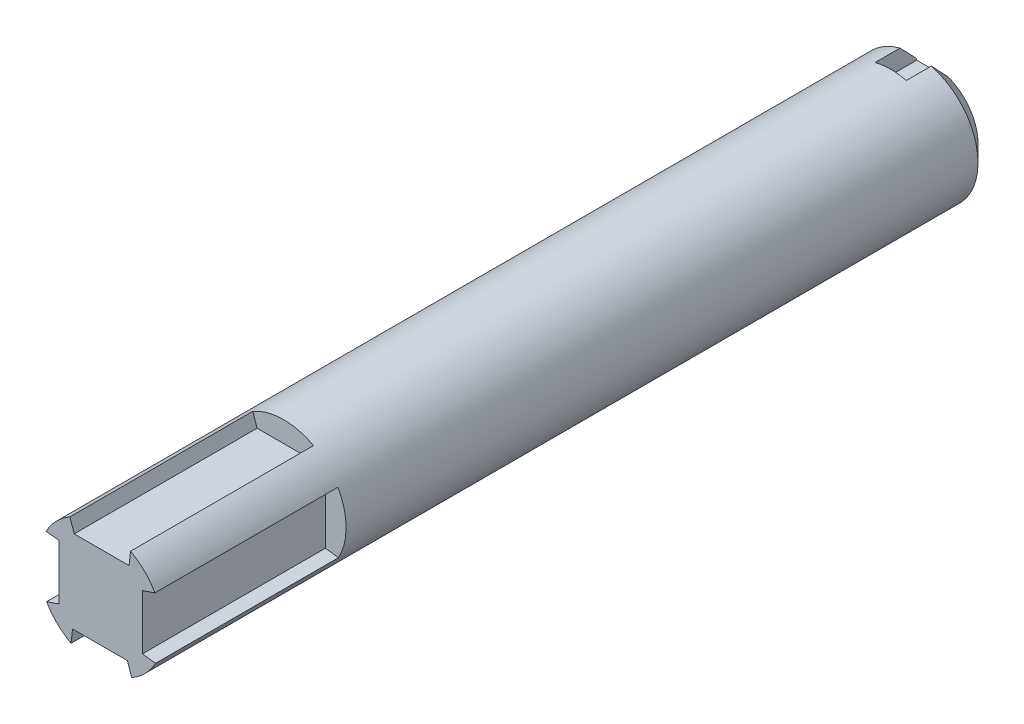
ISO-10303-21;
HEADER;
FILE_DESCRIPTION(('STEP AP214'),'2;1');
FILE_NAME('part.step','',(''),(''),'','','');
FILE_SCHEMA(('AUTOMOTIVE_DESIGN { 1 0 10303 214 1 1 1 1 }'));
ENDSEC;
DATA;
#1=APPLICATION_CONTEXT('core data for automotive mechanical design processes');
#2=APPLICATION_PROTOCOL_DEFINITION('international standard','automotive_design',2000,#1);
#3=PRODUCT_CONTEXT('',#1,'mechanical');
#4=PRODUCT('Part','Part','',(#3));
#5=PRODUCT_RELATED_PRODUCT_CATEGORY('part','',(#4));
#6=PRODUCT_DEFINITION_FORMATION('','',#4);
#7=PRODUCT_DEFINITION_CONTEXT('part definition',#1,'design');
#8=PRODUCT_DEFINITION('design','',#6,#7);
#9=PRODUCT_DEFINITION_SHAPE('','',#8);
#10=(LENGTH_UNIT() NAMED_UNIT(*) SI_UNIT(.MILLI.,.METRE.));
#11=(NAMED_UNIT(*) PLANE_ANGLE_UNIT() SI_UNIT($,.RADIAN.));
#12=(NAMED_UNIT(*) SI_UNIT($,.STERADIAN.) SOLID_ANGLE_UNIT());
#13=UNCERTAINTY_MEASURE_WITH_UNIT(LENGTH_MEASURE(1.E-05),#10,'distance_accuracy_value','');
#14=(GEOMETRIC_REPRESENTATION_CONTEXT(3) GLOBAL_UNCERTAINTY_ASSIGNED_CONTEXT((#13)) GLOBAL_UNIT_ASSIGNED_CONTEXT((#10,
#11,#12)) REPRESENTATION_CONTEXT('',''));
#15=CARTESIAN_POINT('',(0.,0.,0.));
#16=DIRECTION('',(0.,0.,1.));
#17=DIRECTION('',(1.,0.,0.));
#18=AXIS2_PLACEMENT_3D('',#15,#16,#17);
#19=CARTESIAN_POINT('',(0.,0.,-127.));
#20=DIRECTION('',(0.,0.,1.));
#21=DIRECTION('',(1.,0.,0.));
#22=AXIS2_PLACEMENT_3D('',#19,#20,#21);
#23=CYLINDRICAL_SURFACE('',#22,9.525);
#24=DIRECTION('',(0.,0.,1.));
#25=VECTOR('',#24,1.);
#26=CARTESIAN_POINT('',(4.54829804247753,8.36890733111526,-27.94));
#27=LINE('',#26,#25);
#28=CARTESIAN_POINT('',(4.54829804247753,8.36890733111526,-27.94));
#29=VERTEX_POINT('',#28);
#30=CARTESIAN_POINT('',(4.54829804247753,8.36890733111526,0.));
#31=VERTEX_POINT('',#30);
#32=EDGE_CURVE('E371',#29,#31,#27,.T.);
#33=ORIENTED_EDGE('',*,*,#32,.T.);
#34=CARTESIAN_POINT('',(0.,0.,0.));
#35=DIRECTION('',(0.,0.,1.));
#36=DIRECTION('',(1.,0.,0.));
#37=AXIS2_PLACEMENT_3D('',#34,#35,#36);
#38=CIRCLE('',#37,9.525);
#39=CARTESIAN_POINT('',(8.27306868213205,4.72037705916866,0.));
#40=VERTEX_POINT('',#39);
#41=EDGE_CURVE('E389',#40,#31,#38,.T.);
#42=ORIENTED_EDGE('',*,*,#41,.F.);
#43=DIRECTION('',(0.,0.,1.));
#44=VECTOR('',#43,1.);
#45=CARTESIAN_POINT('',(8.27306868213205,4.72037705916865,-27.94));
#46=LINE('',#45,#44);
#47=CARTESIAN_POINT('',(8.27306868213205,4.72037705916865,-27.94));
#48=VERTEX_POINT('',#47);
#49=EDGE_CURVE('E255',#48,#40,#46,.T.);
#50=ORIENTED_EDGE('',*,*,#49,.F.);
#51=CARTESIAN_POINT('',(0.,0.,-27.94));
#52=DIRECTION('',(0.,0.,1.));
#53=DIRECTION('',(1.,0.,0.));
#54=AXIS2_PLACEMENT_3D('',#51,#52,#53);
#55=CIRCLE('',#54,9.525);
#56=CARTESIAN_POINT('',(8.36890733111525,-4.54829804247757,-27.94));
#57=VERTEX_POINT('',#56);
#58=EDGE_CURVE('E238',#57,#48,#55,.T.);
#59=ORIENTED_EDGE('',*,*,#58,.F.);
#60=DIRECTION('',(0.,0.,1.));
#61=VECTOR('',#60,1.);
#62=CARTESIAN_POINT('',(8.36890733111525,-4.54829804247757,-27.94));
#63=LINE('',#62,#61);
#64=CARTESIAN_POINT('',(8.36890733111525,-4.54829804247757,0.));
#65=VERTEX_POINT('',#64);
#66=EDGE_CURVE('E267',#57,#65,#63,.T.);
#67=ORIENTED_EDGE('',*,*,#66,.T.);
#68=CARTESIAN_POINT('',(4.72037705916863,-8.27306868213208,0.));
#69=VERTEX_POINT('',#68);
#70=EDGE_CURVE('E388',#69,#65,#38,.T.);
#71=ORIENTED_EDGE('',*,*,#70,.F.);
#72=DIRECTION('',(0.,0.,1.));
#73=VECTOR('',#72,1.);
#74=CARTESIAN_POINT('',(4.72037705916863,-8.27306868213208,-27.94));
#75=LINE('',#74,#73);
#76=CARTESIAN_POINT('',(4.72037705916863,-8.27306868213208,-27.94));
#77=VERTEX_POINT('',#76);
#78=EDGE_CURVE('E69',#77,#69,#75,.T.);
#79=ORIENTED_EDGE('',*,*,#78,.F.);
#80=CARTESIAN_POINT('',(0.,0.,-27.94));
#81=DIRECTION('',(0.,0.,1.));
#82=DIRECTION('',(1.,0.,0.));
#83=AXIS2_PLACEMENT_3D('',#80,#81,#82);
#84=CIRCLE('',#83,9.525);
#85=CARTESIAN_POINT('',(-4.5482980424776,-8.36890733111525,-27.94));
#86=VERTEX_POINT('',#85);
#87=EDGE_CURVE('E280',#86,#77,#84,.T.);
#88=ORIENTED_EDGE('',*,*,#87,.F.);
#89=DIRECTION('',(0.,0.,1.));
#90=VECTOR('',#89,1.);
#91=CARTESIAN_POINT('',(-4.5482980424776,-8.36890733111525,-27.94));
#92=LINE('',#91,#90);
#93=CARTESIAN_POINT('',(-4.5482980424776,-8.36890733111525,0.));
#94=VERTEX_POINT('',#93);
#95=EDGE_CURVE('E261',#86,#94,#92,.T.);
#96=ORIENTED_EDGE('',*,*,#95,.T.);
#97=CARTESIAN_POINT('',(-8.27306868213208,-4.72037705916863,0.));
#98=VERTEX_POINT('',#97);
#99=EDGE_CURVE('E668',#98,#94,#38,.T.);
#100=ORIENTED_EDGE('',*,*,#99,.F.);
#101=DIRECTION('',(0.,0.,1.));
#102=VECTOR('',#101,1.);
#103=CARTESIAN_POINT('',(-8.27306868213208,-4.72037705916863,-27.94));
#104=LINE('',#103,#102);
#105=CARTESIAN_POINT('',(-8.27306868213208,-4.72037705916863,-27.94));
#106=VERTEX_POINT('',#105);
#107=EDGE_CURVE('E77',#106,#98,#104,.T.);
#108=ORIENTED_EDGE('',*,*,#107,.F.);
#109=CARTESIAN_POINT('',(0.,0.,-27.94));
#110=DIRECTION('',(0.,0.,1.));
#111=DIRECTION('',(1.,0.,0.));
#112=AXIS2_PLACEMENT_3D('',#109,#110,#111);
#113=CIRCLE('',#112,9.525);
#114=CARTESIAN_POINT('',(-8.36890733111524,4.5482980424776,-27.94));
#115=VERTEX_POINT('',#114);
#116=EDGE_CURVE('E318',#115,#106,#113,.T.);
#117=ORIENTED_EDGE('',*,*,#116,.F.);
#118=DIRECTION('',(0.,0.,1.));
#119=VECTOR('',#118,1.);
#120=CARTESIAN_POINT('',(-8.36890733111524,4.5482980424776,-27.94));
#121=LINE('',#120,#119);
#122=CARTESIAN_POINT('',(-8.36890733111524,4.5482980424776,0.));
#123=VERTEX_POINT('',#122);
#124=EDGE_CURVE('E301',#115,#123,#121,.T.);
#125=ORIENTED_EDGE('',*,*,#124,.T.);
#126=CARTESIAN_POINT('',(-4.7203770591687,8.27306868213203,0.));
#127=VERTEX_POINT('',#126);
#128=EDGE_CURVE('E226',#127,#123,#38,.T.);
#129=ORIENTED_EDGE('',*,*,#128,.F.);
#130=DIRECTION('',(0.,0.,1.));
#131=VECTOR('',#130,1.);
#132=CARTESIAN_POINT('',(-4.7203770591687,8.27306868213203,-27.94));
#133=LINE('',#132,#131);
#134=CARTESIAN_POINT('',(-4.7203770591687,8.27306868213203,-27.94));
#135=VERTEX_POINT('',#134);
#136=EDGE_CURVE('E202',#135,#127,#133,.T.);
#137=ORIENTED_EDGE('',*,*,#136,.F.);
#138=CARTESIAN_POINT('',(0.,0.,-27.94));
#139=DIRECTION('',(0.,0.,1.));
#140=DIRECTION('',(1.,0.,0.));
#141=AXIS2_PLACEMENT_3D('',#138,#139,#140);
#142=CIRCLE('',#141,9.525);
#143=EDGE_CURVE('E210',#29,#135,#142,.T.);
#144=ORIENTED_EDGE('',*,*,#143,.F.);
#145=EDGE_LOOP('',(#33,#42,#50,#59,#67,#71,#79,#88,#96,#100,#108,#117,#125,#129,#137,#144));
#146=FACE_BOUND('',#145,.T.);
#147=DIRECTION('',(0.,0.,1.));
#148=VECTOR('',#147,1.);
#149=CARTESIAN_POINT('',(-2.38125,9.2225415931564,-127.));
#150=LINE('',#149,#148);
#151=CARTESIAN_POINT('',(-2.38125,9.2225415931564,-124.46));
#152=VERTEX_POINT('',#151);
#153=CARTESIAN_POINT('',(-2.38125,9.2225415931564,-120.65));
#154=VERTEX_POINT('',#153);
#155=EDGE_CURVE('E385',#152,#154,#150,.T.);
#156=ORIENTED_EDGE('',*,*,#155,.F.);
#157=CARTESIAN_POINT('',(0.,0.,-124.46));
#158=DIRECTION('',(0.,0.,1.));
#159=DIRECTION('',(1.,0.,0.));
#160=AXIS2_PLACEMENT_3D('',#157,#158,#159);
#161=CIRCLE('',#160,9.525);
#162=CARTESIAN_POINT('',(2.38125000000002,9.22254159315641,-124.46));
#163=VERTEX_POINT('',#162);
#164=EDGE_CURVE('E400',#152,#163,#161,.T.);
#165=ORIENTED_EDGE('',*,*,#164,.T.);
#166=DIRECTION('',(0.,0.,1.));
#167=VECTOR('',#166,1.);
#168=CARTESIAN_POINT('',(2.38125000000002,9.22254159315641,-127.));
#169=LINE('',#168,#167);
#170=CARTESIAN_POINT('',(2.38125000000002,9.22254159315641,-120.65));
#171=VERTEX_POINT('',#170);
#172=EDGE_CURVE('E378',#171,#163,#169,.F.);
#173=ORIENTED_EDGE('',*,*,#172,.F.);
#174=CARTESIAN_POINT('',(0.,0.,-120.65));
#175=DIRECTION('',(0.,0.,1.));
#176=DIRECTION('',(1.,0.,0.));
#177=AXIS2_PLACEMENT_3D('',#174,#175,#176);
#178=CIRCLE('',#177,9.525);
#179=EDGE_CURVE('E397',#154,#171,#178,.F.);
#180=ORIENTED_EDGE('',*,*,#179,.F.);
#181=EDGE_LOOP('',(#156,#165,#173,#180));
#182=FACE_BOUND('',#181,.T.);
#183=ADVANCED_FACE('F46',(#146,#182),#23,.T.);
#184=CARTESIAN_POINT('',(0.,0.,-127.));
#185=DIRECTION('',(0.,0.,1.));
#186=DIRECTION('',(1.,0.,0.));
#187=AXIS2_PLACEMENT_3D('',#184,#185,#186);
#188=PLANE('',#187);
#189=DIRECTION('',(0.,1.,0.));
#190=VECTOR('',#189,1.);
#191=CARTESIAN_POINT('',(2.38125,0.,-127.));
#192=LINE('',#191,#190);
#193=CARTESIAN_POINT('',(2.38125,6.34999999999999,-127.));
#194=VERTEX_POINT('',#193);
#195=CARTESIAN_POINT('',(2.38125000000002,6.56657242688299,-127.));
#196=VERTEX_POINT('',#195);
#197=EDGE_CURVE('E393',#194,#196,#192,.T.);
#198=ORIENTED_EDGE('',*,*,#197,.T.);
#199=CARTESIAN_POINT('',(0.,0.,-127.));
#200=DIRECTION('',(0.,0.,1.));
#201=DIRECTION('',(1.,0.,0.));
#202=AXIS2_PLACEMENT_3D('',#199,#200,#201);
#203=CIRCLE('',#202,6.985);
#204=CARTESIAN_POINT('',(-2.38125,6.56657242688298,-127.));
#205=VERTEX_POINT('',#204);
#206=EDGE_CURVE('E62',#196,#205,#203,.F.);
#207=ORIENTED_EDGE('',*,*,#206,.T.);
#208=DIRECTION('',(0.,1.,0.));
#209=VECTOR('',#208,1.);
#210=CARTESIAN_POINT('',(-2.38125,6.34999999999999,-127.));
#211=LINE('',#210,#209);
#212=CARTESIAN_POINT('',(-2.38125,6.34999999999999,-127.));
#213=VERTEX_POINT('',#212);
#214=EDGE_CURVE('E367',#213,#205,#211,.T.);
#215=ORIENTED_EDGE('',*,*,#214,.F.);
#216=DIRECTION('',(-1.,0.,0.));
#217=VECTOR('',#216,1.);
#218=CARTESIAN_POINT('',(2.38125,6.34999999999999,-127.));
#219=LINE('',#218,#217);
#220=EDGE_CURVE('E359',#194,#213,#219,.T.);
#221=ORIENTED_EDGE('',*,*,#220,.F.);
#222=EDGE_LOOP('',(#198,#207,#215,#221));
#223=FACE_BOUND('',#222,.T.);
#224=ADVANCED_FACE('F425',(#223),#188,.F.);
#225=CARTESIAN_POINT('',(0.,0.,0.));
#226=DIRECTION('',(0.,0.,1.));
#227=DIRECTION('',(1.,0.,0.));
#228=AXIS2_PLACEMENT_3D('',#225,#226,#227);
#229=PLANE('',#228);
#230=DIRECTION('',(0.113335650825557,0.993556757438621,0.));
#231=VECTOR('',#230,1.);
#232=CARTESIAN_POINT('',(4.318,6.34999999999999,0.));
#233=LINE('',#232,#231);
#234=CARTESIAN_POINT('',(4.318,6.34999999999999,0.));
#235=VERTEX_POINT('',#234);
#236=EDGE_CURVE('E220',#235,#31,#233,.T.);
#237=ORIENTED_EDGE('',*,*,#236,.F.);
#238=DIRECTION('',(1.,0.,0.));
#239=VECTOR('',#238,1.);
#240=CARTESIAN_POINT('',(-4.064,6.34999999999997,0.));
#241=LINE('',#240,#239);
#242=CARTESIAN_POINT('',(-4.064,6.34999999999997,0.));
#243=VERTEX_POINT('',#242);
#244=EDGE_CURVE('E642',#243,#235,#241,.T.);
#245=ORIENTED_EDGE('',*,*,#244,.F.);
#246=DIRECTION('',(0.323020206283803,-0.946392067978367,0.));
#247=VECTOR('',#246,1.);
#248=CARTESIAN_POINT('',(-4.7203770591687,8.27306868213203,0.));
#249=LINE('',#248,#247);
#250=EDGE_CURVE('E271',#127,#243,#249,.T.);
#251=ORIENTED_EDGE('',*,*,#250,.F.);
#252=ORIENTED_EDGE('',*,*,#128,.T.);
#253=DIRECTION('',(-0.99355675743862,0.113335650825567,0.));
#254=VECTOR('',#253,1.);
#255=CARTESIAN_POINT('',(-6.34999999999995,4.31800000000005,0.));
#256=LINE('',#255,#254);
#257=CARTESIAN_POINT('',(-6.34999999999995,4.31800000000005,0.));
#258=VERTEX_POINT('',#257);
#259=EDGE_CURVE('E323',#258,#123,#256,.T.);
#260=ORIENTED_EDGE('',*,*,#259,.F.);
#261=DIRECTION('',(0.,1.,0.));
#262=VECTOR('',#261,1.);
#263=CARTESIAN_POINT('',(-6.35000000000004,-4.06399999999994,0.));
#264=LINE('',#263,#262);
#265=CARTESIAN_POINT('',(-6.35000000000004,-4.06399999999994,0.));
#266=VERTEX_POINT('',#265);
#267=EDGE_CURVE('E338',#266,#258,#264,.T.);
#268=ORIENTED_EDGE('',*,*,#267,.F.);
#269=DIRECTION('',(0.94639206797837,0.323020206283793,0.));
#270=VECTOR('',#269,1.);
#271=CARTESIAN_POINT('',(-8.27306868213208,-4.72037705916863,0.));
#272=LINE('',#271,#270);
#273=EDGE_CURVE('E335',#98,#266,#272,.T.);
#274=ORIENTED_EDGE('',*,*,#273,.F.);
#275=ORIENTED_EDGE('',*,*,#99,.T.);
#276=DIRECTION('',(-0.113335650825564,-0.993556757438621,0.));
#277=VECTOR('',#276,1.);
#278=CARTESIAN_POINT('',(-4.31800000000006,-6.34999999999998,0.));
#279=LINE('',#278,#277);
#280=CARTESIAN_POINT('',(-4.31800000000006,-6.34999999999998,0.));
#281=VERTEX_POINT('',#280);
#282=EDGE_CURVE('E285',#281,#94,#279,.T.);
#283=ORIENTED_EDGE('',*,*,#282,.F.);
#284=DIRECTION('',(-1.,0.,0.));
#285=VECTOR('',#284,1.);
#286=CARTESIAN_POINT('',(4.06399999999996,-6.35000000000004,0.));
#287=LINE('',#286,#285);
#288=CARTESIAN_POINT('',(4.06399999999996,-6.35000000000004,0.));
#289=VERTEX_POINT('',#288);
#290=EDGE_CURVE('E300',#289,#281,#287,.T.);
#291=ORIENTED_EDGE('',*,*,#290,.F.);
#292=DIRECTION('',(-0.323020206283796,0.946392067978369,0.));
#293=VECTOR('',#292,1.);
#294=CARTESIAN_POINT('',(4.72037705916863,-8.27306868213208,0.));
#295=LINE('',#294,#293);
#296=EDGE_CURVE('E297',#69,#289,#295,.T.);
#297=ORIENTED_EDGE('',*,*,#296,.F.);
#298=ORIENTED_EDGE('',*,*,#70,.T.);
#299=DIRECTION('',(0.993556757438621,-0.113335650825561,0.));
#300=VECTOR('',#299,1.);
#301=CARTESIAN_POINT('',(6.34999999999998,-4.31800000000003,0.));
#302=LINE('',#301,#300);
#303=CARTESIAN_POINT('',(6.34999999999998,-4.31800000000003,0.));
#304=VERTEX_POINT('',#303);
#305=EDGE_CURVE('E243',#304,#65,#302,.T.);
#306=ORIENTED_EDGE('',*,*,#305,.F.);
#307=DIRECTION('',(0.,-1.,0.));
#308=VECTOR('',#307,1.);
#309=CARTESIAN_POINT('',(6.35000000000001,4.06399999999996,0.));
#310=LINE('',#309,#308);
#311=CARTESIAN_POINT('',(6.35000000000001,4.06399999999996,0.));
#312=VERTEX_POINT('',#311);
#313=EDGE_CURVE('E260',#312,#304,#310,.T.);
#314=ORIENTED_EDGE('',*,*,#313,.F.);
#315=DIRECTION('',(-0.946392067978368,-0.3230202062838,0.));
#316=VECTOR('',#315,1.);
#317=CARTESIAN_POINT('',(8.27306868213205,4.72037705916866,0.));
#318=LINE('',#317,#316);
#319=EDGE_CURVE('E256',#40,#312,#318,.T.);
#320=ORIENTED_EDGE('',*,*,#319,.F.);
#321=ORIENTED_EDGE('',*,*,#41,.T.);
#322=EDGE_LOOP('',(#237,#245,#251,#252,#260,#268,#274,#275,#283,#291,#297,#298,#306,#314,#320,#321));
#323=FACE_BOUND('',#322,.T.);
#324=ADVANCED_FACE('F423',(#323),#229,.T.);
#325=CARTESIAN_POINT('',(-2.38125,6.34999999999999,-120.65));
#326=DIRECTION('',(-1.,0.,0.));
#327=DIRECTION('',(0.,-1.,0.));
#328=AXIS2_PLACEMENT_3D('',#325,#326,#327);
#329=PLANE('',#328);
#330=ORIENTED_EDGE('',*,*,#214,.T.);
#331=CARTESIAN_POINT('',(-2.38125,6.56657242688298,-127.));
#332=CARTESIAN_POINT('',(-2.38125,6.78969457040643,-126.790212902821));
#333=CARTESIAN_POINT('',(-2.38125,7.01222702652971,-126.579801136889));
#334=CARTESIAN_POINT('',(-2.38125,7.45633390437833,-126.157974415259));
#335=CARTESIAN_POINT('',(-2.38125,7.67790833858042,-125.9465594727));
#336=CARTESIAN_POINT('',(-2.38125,8.12032511170404,-125.522968218927));
#337=CARTESIAN_POINT('',(-2.38125,8.34116745465258,-125.310791911914));
#338=CARTESIAN_POINT('',(-2.38125,8.78226269348387,-124.885821627688));
#339=CARTESIAN_POINT('',(-2.38125,9.00251558168866,-124.673027642503));
#340=CARTESIAN_POINT('',(-2.38125,9.2225415931564,-124.46));
#341=B_SPLINE_CURVE_WITH_KNOTS('',3,(#331,#332,#333,#334,#335,#336,#337,#338,#339,#340),
.UNSPECIFIED.,.F.,.F.,(4,2,2,2,4),(0.,0.918771102938876,1.83753020403531,2.75628424291785,
3.67505019139119),.UNSPECIFIED.);
#342=EDGE_CURVE('E11',#205,#152,#341,.T.);
#343=ORIENTED_EDGE('',*,*,#342,.T.);
#344=ORIENTED_EDGE('',*,*,#155,.T.);
#345=DIRECTION('',(0.,1.,0.));
#346=VECTOR('',#345,1.);
#347=CARTESIAN_POINT('',(-2.38125,6.34999999999999,-120.65));
#348=LINE('',#347,#346);
#349=CARTESIAN_POINT('',(-2.38125,6.34999999999999,-120.65));
#350=VERTEX_POINT('',#349);
#351=EDGE_CURVE('E354',#350,#154,#348,.T.);
#352=ORIENTED_EDGE('',*,*,#351,.F.);
#353=DIRECTION('',(0.,0.,-1.));
#354=VECTOR('',#353,1.);
#355=CARTESIAN_POINT('',(-2.38125,6.34999999999999,-120.65));
#356=LINE('',#355,#354);
#357=EDGE_CURVE('E375',#350,#213,#356,.T.);
#358=ORIENTED_EDGE('',*,*,#357,.T.);
#359=EDGE_LOOP('',(#330,#343,#344,#352,#358));
#360=FACE_BOUND('',#359,.T.);
#361=ADVANCED_FACE('F419',(#360),#329,.F.);
#362=CARTESIAN_POINT('',(2.38125,6.34999999999999,-120.65));
#363=DIRECTION('',(0.,-1.,0.));
#364=DIRECTION('',(1.,0.,0.));
#365=AXIS2_PLACEMENT_3D('',#362,#363,#364);
#366=PLANE('',#365);
#367=ORIENTED_EDGE('',*,*,#220,.T.);
#368=ORIENTED_EDGE('',*,*,#357,.F.);
#369=DIRECTION('',(-1.,0.,0.));
#370=VECTOR('',#369,1.);
#371=CARTESIAN_POINT('',(2.38125,6.34999999999999,-120.65));
#372=LINE('',#371,#370);
#373=CARTESIAN_POINT('',(2.38125,6.34999999999999,-120.65));
#374=VERTEX_POINT('',#373);
#375=EDGE_CURVE('E362',#374,#350,#372,.T.);
#376=ORIENTED_EDGE('',*,*,#375,.F.);
#377=DIRECTION('',(0.,0.,-1.));
#378=VECTOR('',#377,1.);
#379=CARTESIAN_POINT('',(2.38125,6.34999999999999,-120.65));
#380=LINE('',#379,#378);
#381=EDGE_CURVE('E366',#374,#194,#380,.T.);
#382=ORIENTED_EDGE('',*,*,#381,.T.);
#383=EDGE_LOOP('',(#367,#368,#376,#382));
#384=FACE_BOUND('',#383,.T.);
#385=ADVANCED_FACE('F416',(#384),#366,.F.);
#386=CARTESIAN_POINT('',(2.38125,6.34999999999999,-120.65));
#387=DIRECTION('',(1.,0.,0.));
#388=DIRECTION('',(0.,1.,0.));
#389=AXIS2_PLACEMENT_3D('',#386,#387,#388);
#390=PLANE('',#389);
#391=ORIENTED_EDGE('',*,*,#172,.T.);
#392=CARTESIAN_POINT('',(2.38125000000002,9.22254159315641,-124.46));
#393=CARTESIAN_POINT('',(2.38125000000001,9.00251558168865,-124.673027642503));
#394=CARTESIAN_POINT('',(2.38125,8.78226269348386,-124.885821627688));
#395=CARTESIAN_POINT('',(2.38125,8.34116745465257,-125.310791911914));
#396=CARTESIAN_POINT('',(2.38125,8.12032511170405,-125.522968218927));
#397=CARTESIAN_POINT('',(2.38125,7.67790833858042,-125.9465594727));
#398=CARTESIAN_POINT('',(2.38125,7.45633390437832,-126.157974415259));
#399=CARTESIAN_POINT('',(2.38125,7.0122270265297,-126.579801136889));
#400=CARTESIAN_POINT('',(2.38125,6.78969457040642,-126.790212902821));
#401=CARTESIAN_POINT('',(2.38125,6.56657242688298,-127.));
#402=B_SPLINE_CURVE_WITH_KNOTS('',3,(#392,#393,#394,#395,#396,#397,#398,#399,#400,#401),
.UNSPECIFIED.,.F.,.F.,(4,2,2,2,4),(0.,0.918765948473346,1.83751998735588,2.75627908845232,
3.67505019139119),.UNSPECIFIED.);
#403=EDGE_CURVE('E404',#163,#196,#402,.T.);
#404=ORIENTED_EDGE('',*,*,#403,.T.);
#405=ORIENTED_EDGE('',*,*,#197,.F.);
#406=ORIENTED_EDGE('',*,*,#381,.F.);
#407=DIRECTION('',(0.,-1.,0.));
#408=VECTOR('',#407,1.);
#409=CARTESIAN_POINT('',(2.38125,6.34999999999999,-120.65));
#410=LINE('',#409,#408);
#411=EDGE_CURVE('E358',#171,#374,#410,.T.);
#412=ORIENTED_EDGE('',*,*,#411,.F.);
#413=EDGE_LOOP('',(#391,#404,#405,#406,#412));
#414=FACE_BOUND('',#413,.T.);
#415=ADVANCED_FACE('F411',(#414),#390,.F.);
#416=CARTESIAN_POINT('',(0.,0.,-120.65));
#417=DIRECTION('',(0.,0.,1.));
#418=DIRECTION('',(1.,0.,0.));
#419=AXIS2_PLACEMENT_3D('',#416,#417,#418);
#420=PLANE('',#419);
#421=ORIENTED_EDGE('',*,*,#351,.T.);
#422=ORIENTED_EDGE('',*,*,#179,.T.);
#423=ORIENTED_EDGE('',*,*,#411,.T.);
#424=ORIENTED_EDGE('',*,*,#375,.T.);
#425=EDGE_LOOP('',(#421,#422,#423,#424));
#426=FACE_BOUND('',#425,.T.);
#427=ADVANCED_FACE('F415',(#426),#420,.F.);
#428=CARTESIAN_POINT('',(0.,0.,-124.46));
#429=DIRECTION('',(0.,0.,1.));
#430=DIRECTION('',(1.,0.,0.));
#431=AXIS2_PLACEMENT_3D('',#428,#429,#430);
#432=CONICAL_SURFACE('',#431,9.525,0.785398163397445);
#433=ORIENTED_EDGE('',*,*,#342,.F.);
#434=ORIENTED_EDGE('',*,*,#206,.F.);
#435=ORIENTED_EDGE('',*,*,#403,.F.);
#436=ORIENTED_EDGE('',*,*,#164,.F.);
#437=EDGE_LOOP('',(#433,#434,#435,#436));
#438=FACE_BOUND('',#437,.T.);
#439=ADVANCED_FACE('F49',(#438),#432,.T.);
#440=CARTESIAN_POINT('',(-6.34999999999995,4.31800000000005,-27.94));
#441=DIRECTION('',(0.113335650825567,0.99355675743862,0.));
#442=DIRECTION('',(-0.99355675743862,0.113335650825567,0.));
#443=AXIS2_PLACEMENT_3D('',#440,#441,#442);
#444=PLANE('',#443);
#445=ORIENTED_EDGE('',*,*,#259,.T.);
#446=ORIENTED_EDGE('',*,*,#124,.F.);
#447=DIRECTION('',(-0.99355675743862,0.113335650825567,0.));
#448=VECTOR('',#447,1.);
#449=CARTESIAN_POINT('',(-6.34999999999995,4.31800000000005,-27.94));
#450=LINE('',#449,#448);
#451=CARTESIAN_POINT('',(-6.34999999999995,4.31800000000005,-27.94));
#452=VERTEX_POINT('',#451);
#453=EDGE_CURVE('E331',#452,#115,#450,.T.);
#454=ORIENTED_EDGE('',*,*,#453,.F.);
#455=DIRECTION('',(0.,0.,1.));
#456=VECTOR('',#455,1.);
#457=CARTESIAN_POINT('',(-6.34999999999995,4.31800000000005,-27.94));
#458=LINE('',#457,#456);
#459=EDGE_CURVE('E346',#452,#258,#458,.T.);
#460=ORIENTED_EDGE('',*,*,#459,.T.);
#461=EDGE_LOOP('',(#445,#446,#454,#460));
#462=FACE_BOUND('',#461,.T.);
#463=ADVANCED_FACE('F468',(#462),#444,.F.);
#464=CARTESIAN_POINT('',(-6.35000000000004,-4.06399999999994,-27.94));
#465=DIRECTION('',(1.,0.,0.));
#466=DIRECTION('',(0.,1.,0.));
#467=AXIS2_PLACEMENT_3D('',#464,#465,#466);
#468=PLANE('',#467);
#469=ORIENTED_EDGE('',*,*,#267,.T.);
#470=ORIENTED_EDGE('',*,*,#459,.F.);
#471=DIRECTION('',(0.,1.,0.));
#472=VECTOR('',#471,1.);
#473=CARTESIAN_POINT('',(-6.35000000000004,-4.06399999999994,-27.94));
#474=LINE('',#473,#472);
#475=CARTESIAN_POINT('',(-6.35000000000004,-4.06399999999994,-27.94));
#476=VERTEX_POINT('',#475);
#477=EDGE_CURVE('E327',#476,#452,#474,.T.);
#478=ORIENTED_EDGE('',*,*,#477,.F.);
#479=DIRECTION('',(0.,0.,1.));
#480=VECTOR('',#479,1.);
#481=CARTESIAN_POINT('',(-6.35000000000004,-4.06399999999994,-27.94));
#482=LINE('',#481,#480);
#483=EDGE_CURVE('E349',#476,#266,#482,.T.);
#484=ORIENTED_EDGE('',*,*,#483,.T.);
#485=EDGE_LOOP('',(#469,#470,#478,#484));
#486=FACE_BOUND('',#485,.T.);
#487=ADVANCED_FACE('F475',(#486),#468,.F.);
#488=CARTESIAN_POINT('',(-8.27306868213208,-4.72037705916863,-27.94));
#489=DIRECTION('',(0.323020206283793,-0.94639206797837,0.));
#490=DIRECTION('',(0.94639206797837,0.323020206283793,0.));
#491=AXIS2_PLACEMENT_3D('',#488,#489,#490);
#492=PLANE('',#491);
#493=ORIENTED_EDGE('',*,*,#273,.T.);
#494=ORIENTED_EDGE('',*,*,#483,.F.);
#495=DIRECTION('',(0.94639206797837,0.323020206283793,0.));
#496=VECTOR('',#495,1.);
#497=CARTESIAN_POINT('',(-8.27306868213208,-4.72037705916863,-27.94));
#498=LINE('',#497,#496);
#499=EDGE_CURVE('E322',#106,#476,#498,.T.);
#500=ORIENTED_EDGE('',*,*,#499,.F.);
#501=ORIENTED_EDGE('',*,*,#107,.T.);
#502=EDGE_LOOP('',(#493,#494,#500,#501));
#503=FACE_BOUND('',#502,.T.);
#504=ADVANCED_FACE('F483',(#503),#492,.F.);
#505=CARTESIAN_POINT('',(0.,0.,-27.94));
#506=DIRECTION('',(0.,0.,1.));
#507=DIRECTION('',(1.,0.,0.));
#508=AXIS2_PLACEMENT_3D('',#505,#506,#507);
#509=PLANE('',#508);
#510=ORIENTED_EDGE('',*,*,#116,.T.);
#511=ORIENTED_EDGE('',*,*,#499,.T.);
#512=ORIENTED_EDGE('',*,*,#477,.T.);
#513=ORIENTED_EDGE('',*,*,#453,.T.);
#514=EDGE_LOOP('',(#510,#511,#512,#513));
#515=FACE_BOUND('',#514,.T.);
#516=ADVANCED_FACE('F491',(#515),#509,.T.);
#517=CARTESIAN_POINT('',(-4.31800000000006,-6.34999999999998,-27.94));
#518=DIRECTION('',(-0.993556757438621,0.113335650825564,0.));
#519=DIRECTION('',(-0.113335650825564,-0.993556757438621,0.));
#520=AXIS2_PLACEMENT_3D('',#517,#518,#519);
#521=PLANE('',#520);
#522=ORIENTED_EDGE('',*,*,#282,.T.);
#523=ORIENTED_EDGE('',*,*,#95,.F.);
#524=DIRECTION('',(-0.113335650825564,-0.993556757438621,0.));
#525=VECTOR('',#524,1.);
#526=CARTESIAN_POINT('',(-4.31800000000006,-6.34999999999998,-27.94));
#527=LINE('',#526,#525);
#528=CARTESIAN_POINT('',(-4.31800000000006,-6.34999999999998,-27.94));
#529=VERTEX_POINT('',#528);
#530=EDGE_CURVE('E293',#529,#86,#527,.T.);
#531=ORIENTED_EDGE('',*,*,#530,.F.);
#532=DIRECTION('',(0.,0.,1.));
#533=VECTOR('',#532,1.);
#534=CARTESIAN_POINT('',(-4.31800000000006,-6.34999999999998,-27.94));
#535=LINE('',#534,#533);
#536=EDGE_CURVE('E310',#529,#281,#535,.T.);
#537=ORIENTED_EDGE('',*,*,#536,.T.);
#538=EDGE_LOOP('',(#522,#523,#531,#537));
#539=FACE_BOUND('',#538,.T.);
#540=ADVANCED_FACE('F498',(#539),#521,.F.);
#541=CARTESIAN_POINT('',(4.06399999999996,-6.35000000000004,-27.94));
#542=DIRECTION('',(0.,1.,0.));
#543=DIRECTION('',(-1.,0.,0.));
#544=AXIS2_PLACEMENT_3D('',#541,#542,#543);
#545=PLANE('',#544);
#546=ORIENTED_EDGE('',*,*,#290,.T.);
#547=ORIENTED_EDGE('',*,*,#536,.F.);
#548=DIRECTION('',(-1.,0.,0.));
#549=VECTOR('',#548,1.);
#550=CARTESIAN_POINT('',(4.06399999999996,-6.35000000000004,-27.94));
#551=LINE('',#550,#549);
#552=CARTESIAN_POINT('',(4.06399999999996,-6.35000000000004,-27.94));
#553=VERTEX_POINT('',#552);
#554=EDGE_CURVE('E289',#553,#529,#551,.T.);
#555=ORIENTED_EDGE('',*,*,#554,.F.);
#556=DIRECTION('',(0.,0.,1.));
#557=VECTOR('',#556,1.);
#558=CARTESIAN_POINT('',(4.06399999999996,-6.35000000000004,-27.94));
#559=LINE('',#558,#557);
#560=EDGE_CURVE('E313',#553,#289,#559,.T.);
#561=ORIENTED_EDGE('',*,*,#560,.T.);
#562=EDGE_LOOP('',(#546,#547,#555,#561));
#563=FACE_BOUND('',#562,.T.);
#564=ADVANCED_FACE('F506',(#563),#545,.F.);
#565=CARTESIAN_POINT('',(4.72037705916863,-8.27306868213208,-27.94));
#566=DIRECTION('',(0.946392067978369,0.323020206283796,0.));
#567=DIRECTION('',(-0.323020206283796,0.946392067978369,0.));
#568=AXIS2_PLACEMENT_3D('',#565,#566,#567);
#569=PLANE('',#568);
#570=ORIENTED_EDGE('',*,*,#296,.T.);
#571=ORIENTED_EDGE('',*,*,#560,.F.);
#572=DIRECTION('',(-0.323020206283796,0.946392067978369,0.));
#573=VECTOR('',#572,1.);
#574=CARTESIAN_POINT('',(4.72037705916863,-8.27306868213208,-27.94));
#575=LINE('',#574,#573);
#576=EDGE_CURVE('E284',#77,#553,#575,.T.);
#577=ORIENTED_EDGE('',*,*,#576,.F.);
#578=ORIENTED_EDGE('',*,*,#78,.T.);
#579=EDGE_LOOP('',(#570,#571,#577,#578));
#580=FACE_BOUND('',#579,.T.);
#581=ADVANCED_FACE('F514',(#580),#569,.F.);
#582=CARTESIAN_POINT('',(0.,0.,-27.94));
#583=DIRECTION('',(0.,0.,1.));
#584=DIRECTION('',(1.,0.,0.));
#585=AXIS2_PLACEMENT_3D('',#582,#583,#584);
#586=PLANE('',#585);
#587=ORIENTED_EDGE('',*,*,#87,.T.);
#588=ORIENTED_EDGE('',*,*,#576,.T.);
#589=ORIENTED_EDGE('',*,*,#554,.T.);
#590=ORIENTED_EDGE('',*,*,#530,.T.);
#591=EDGE_LOOP('',(#587,#588,#589,#590));
#592=FACE_BOUND('',#591,.T.);
#593=ADVANCED_FACE('F522',(#592),#586,.T.);
#594=CARTESIAN_POINT('',(6.34999999999998,-4.31800000000003,-27.94));
#595=DIRECTION('',(-0.113335650825561,-0.993556757438621,0.));
#596=DIRECTION('',(0.993556757438621,-0.113335650825561,0.));
#597=AXIS2_PLACEMENT_3D('',#594,#595,#596);
#598=PLANE('',#597);
#599=ORIENTED_EDGE('',*,*,#305,.T.);
#600=ORIENTED_EDGE('',*,*,#66,.F.);
#601=DIRECTION('',(0.993556757438621,-0.113335650825561,0.));
#602=VECTOR('',#601,1.);
#603=CARTESIAN_POINT('',(6.34999999999998,-4.31800000000003,-27.94));
#604=LINE('',#603,#602);
#605=CARTESIAN_POINT('',(6.34999999999998,-4.31800000000003,-27.94));
#606=VERTEX_POINT('',#605);
#607=EDGE_CURVE('E251',#606,#57,#604,.T.);
#608=ORIENTED_EDGE('',*,*,#607,.F.);
#609=DIRECTION('',(0.,0.,1.));
#610=VECTOR('',#609,1.);
#611=CARTESIAN_POINT('',(6.34999999999998,-4.31800000000003,-27.94));
#612=LINE('',#611,#610);
#613=EDGE_CURVE('E272',#606,#304,#612,.T.);
#614=ORIENTED_EDGE('',*,*,#613,.T.);
#615=EDGE_LOOP('',(#599,#600,#608,#614));
#616=FACE_BOUND('',#615,.T.);
#617=ADVANCED_FACE('F529',(#616),#598,.F.);
#618=CARTESIAN_POINT('',(6.35000000000001,4.06399999999996,-27.94));
#619=DIRECTION('',(-1.,0.,0.));
#620=DIRECTION('',(0.,-1.,0.));
#621=AXIS2_PLACEMENT_3D('',#618,#619,#620);
#622=PLANE('',#621);
#623=ORIENTED_EDGE('',*,*,#313,.T.);
#624=ORIENTED_EDGE('',*,*,#613,.F.);
#625=DIRECTION('',(0.,-1.,0.));
#626=VECTOR('',#625,1.);
#627=CARTESIAN_POINT('',(6.35000000000001,4.06399999999996,-27.94));
#628=LINE('',#627,#626);
#629=CARTESIAN_POINT('',(6.35000000000001,4.06399999999996,-27.94));
#630=VERTEX_POINT('',#629);
#631=EDGE_CURVE('E247',#630,#606,#628,.T.);
#632=ORIENTED_EDGE('',*,*,#631,.F.);
#633=DIRECTION('',(0.,0.,1.));
#634=VECTOR('',#633,1.);
#635=CARTESIAN_POINT('',(6.35000000000001,4.06399999999996,-27.94));
#636=LINE('',#635,#634);
#637=EDGE_CURVE('E275',#630,#312,#636,.T.);
#638=ORIENTED_EDGE('',*,*,#637,.T.);
#639=EDGE_LOOP('',(#623,#624,#632,#638));
#640=FACE_BOUND('',#639,.T.);
#641=ADVANCED_FACE('F537',(#640),#622,.F.);
#642=CARTESIAN_POINT('',(8.27306868213205,4.72037705916865,-27.94));
#643=DIRECTION('',(-0.3230202062838,0.946392067978368,0.));
#644=DIRECTION('',(-0.946392067978368,-0.3230202062838,0.));
#645=AXIS2_PLACEMENT_3D('',#642,#643,#644);
#646=PLANE('',#645);
#647=ORIENTED_EDGE('',*,*,#319,.T.);
#648=ORIENTED_EDGE('',*,*,#637,.F.);
#649=DIRECTION('',(-0.946392067978368,-0.3230202062838,0.));
#650=VECTOR('',#649,1.);
#651=CARTESIAN_POINT('',(8.27306868213205,4.72037705916865,-27.94));
#652=LINE('',#651,#650);
#653=EDGE_CURVE('E242',#48,#630,#652,.T.);
#654=ORIENTED_EDGE('',*,*,#653,.F.);
#655=ORIENTED_EDGE('',*,*,#49,.T.);
#656=EDGE_LOOP('',(#647,#648,#654,#655));
#657=FACE_BOUND('',#656,.T.);
#658=ADVANCED_FACE('F545',(#657),#646,.F.);
#659=CARTESIAN_POINT('',(0.,0.,-27.94));
#660=DIRECTION('',(0.,0.,1.));
#661=DIRECTION('',(1.,0.,0.));
#662=AXIS2_PLACEMENT_3D('',#659,#660,#661);
#663=PLANE('',#662);
#664=ORIENTED_EDGE('',*,*,#58,.T.);
#665=ORIENTED_EDGE('',*,*,#653,.T.);
#666=ORIENTED_EDGE('',*,*,#631,.T.);
#667=ORIENTED_EDGE('',*,*,#607,.T.);
#668=EDGE_LOOP('',(#664,#665,#666,#667));
#669=FACE_BOUND('',#668,.T.);
#670=ADVANCED_FACE('F553',(#669),#663,.T.);
#671=CARTESIAN_POINT('',(4.318,6.34999999999999,-27.94));
#672=DIRECTION('',(0.993556757438621,-0.113335650825557,0.));
#673=DIRECTION('',(0.113335650825557,0.993556757438622,0.));
#674=AXIS2_PLACEMENT_3D('',#671,#672,#673);
#675=PLANE('',#674);
#676=ORIENTED_EDGE('',*,*,#236,.T.);
#677=ORIENTED_EDGE('',*,*,#32,.F.);
#678=DIRECTION('',(0.113335650825557,0.993556757438621,0.));
#679=VECTOR('',#678,1.);
#680=CARTESIAN_POINT('',(4.318,6.34999999999999,-27.94));
#681=LINE('',#680,#679);
#682=CARTESIAN_POINT('',(4.318,6.34999999999999,-27.94));
#683=VERTEX_POINT('',#682);
#684=EDGE_CURVE('E216',#683,#29,#681,.T.);
#685=ORIENTED_EDGE('',*,*,#684,.F.);
#686=DIRECTION('',(0.,0.,1.));
#687=VECTOR('',#686,1.);
#688=CARTESIAN_POINT('',(4.318,6.34999999999999,-27.94));
#689=LINE('',#688,#687);
#690=EDGE_CURVE('E233',#683,#235,#689,.T.);
#691=ORIENTED_EDGE('',*,*,#690,.T.);
#692=EDGE_LOOP('',(#676,#677,#685,#691));
#693=FACE_BOUND('',#692,.T.);
#694=ADVANCED_FACE('F561',(#693),#675,.F.);
#695=CARTESIAN_POINT('',(-4.064,6.34999999999997,-27.94));
#696=DIRECTION('',(0.,-1.,0.));
#697=DIRECTION('',(0.,0.,-1.));
#698=AXIS2_PLACEMENT_3D('',#695,#696,#697);
#699=PLANE('',#698);
#700=ORIENTED_EDGE('',*,*,#244,.T.);
#701=ORIENTED_EDGE('',*,*,#690,.F.);
#702=DIRECTION('',(1.,0.,0.));
#703=VECTOR('',#702,1.);
#704=CARTESIAN_POINT('',(-4.064,6.34999999999997,-27.94));
#705=LINE('',#704,#703);
#706=CARTESIAN_POINT('',(-4.064,6.34999999999997,-27.94));
#707=VERTEX_POINT('',#706);
#708=EDGE_CURVE('E209',#707,#683,#705,.T.);
#709=ORIENTED_EDGE('',*,*,#708,.F.);
#710=DIRECTION('',(0.,0.,1.));
#711=VECTOR('',#710,1.);
#712=CARTESIAN_POINT('',(-4.064,6.34999999999997,-27.94));
#713=LINE('',#712,#711);
#714=EDGE_CURVE('E204',#707,#243,#713,.T.);
#715=ORIENTED_EDGE('',*,*,#714,.T.);
#716=EDGE_LOOP('',(#700,#701,#709,#715));
#717=FACE_BOUND('',#716,.T.);
#718=ADVANCED_FACE('F569',(#717),#699,.F.);
#719=CARTESIAN_POINT('',(-4.7203770591687,8.27306868213203,-27.94));
#720=DIRECTION('',(-0.946392067978367,-0.323020206283803,0.));
#721=DIRECTION('',(0.323020206283803,-0.946392067978367,0.));
#722=AXIS2_PLACEMENT_3D('',#719,#720,#721);
#723=PLANE('',#722);
#724=ORIENTED_EDGE('',*,*,#250,.T.);
#725=ORIENTED_EDGE('',*,*,#714,.F.);
#726=DIRECTION('',(0.323020206283803,-0.946392067978367,0.));
#727=VECTOR('',#726,1.);
#728=CARTESIAN_POINT('',(-4.7203770591687,8.27306868213203,-27.94));
#729=LINE('',#728,#727);
#730=EDGE_CURVE('E197',#135,#707,#729,.T.);
#731=ORIENTED_EDGE('',*,*,#730,.F.);
#732=ORIENTED_EDGE('',*,*,#136,.T.);
#733=EDGE_LOOP('',(#724,#725,#731,#732));
#734=FACE_BOUND('',#733,.T.);
#735=ADVANCED_FACE('F200',(#734),#723,.F.);
#736=CARTESIAN_POINT('',(0.,0.,-27.94));
#737=DIRECTION('',(0.,0.,1.));
#738=DIRECTION('',(1.,0.,0.));
#739=AXIS2_PLACEMENT_3D('',#736,#737,#738);
#740=PLANE('',#739);
#741=ORIENTED_EDGE('',*,*,#143,.T.);
#742=ORIENTED_EDGE('',*,*,#730,.T.);
#743=ORIENTED_EDGE('',*,*,#708,.T.);
#744=ORIENTED_EDGE('',*,*,#684,.T.);
#745=EDGE_LOOP('',(#741,#742,#743,#744));
#746=FACE_BOUND('',#745,.T.);
#747=ADVANCED_FACE('F214',(#746),#740,.T.);
#748=CLOSED_SHELL('',(#183,#224,#324,#361,#385,#415,#427,#439,#463,#487,#504,#516,#540,#564,
#581,#593,#617,#641,#658,#670,#694,#718,#735,#747));
#749=MANIFOLD_SOLID_BREP('B2',#748);
#750=ADVANCED_BREP_SHAPE_REPRESENTATION('',(#18,#749),#14);
#751=SHAPE_DEFINITION_REPRESENTATION(#9,#750);
ENDSEC;
END-ISO-10303-21;
